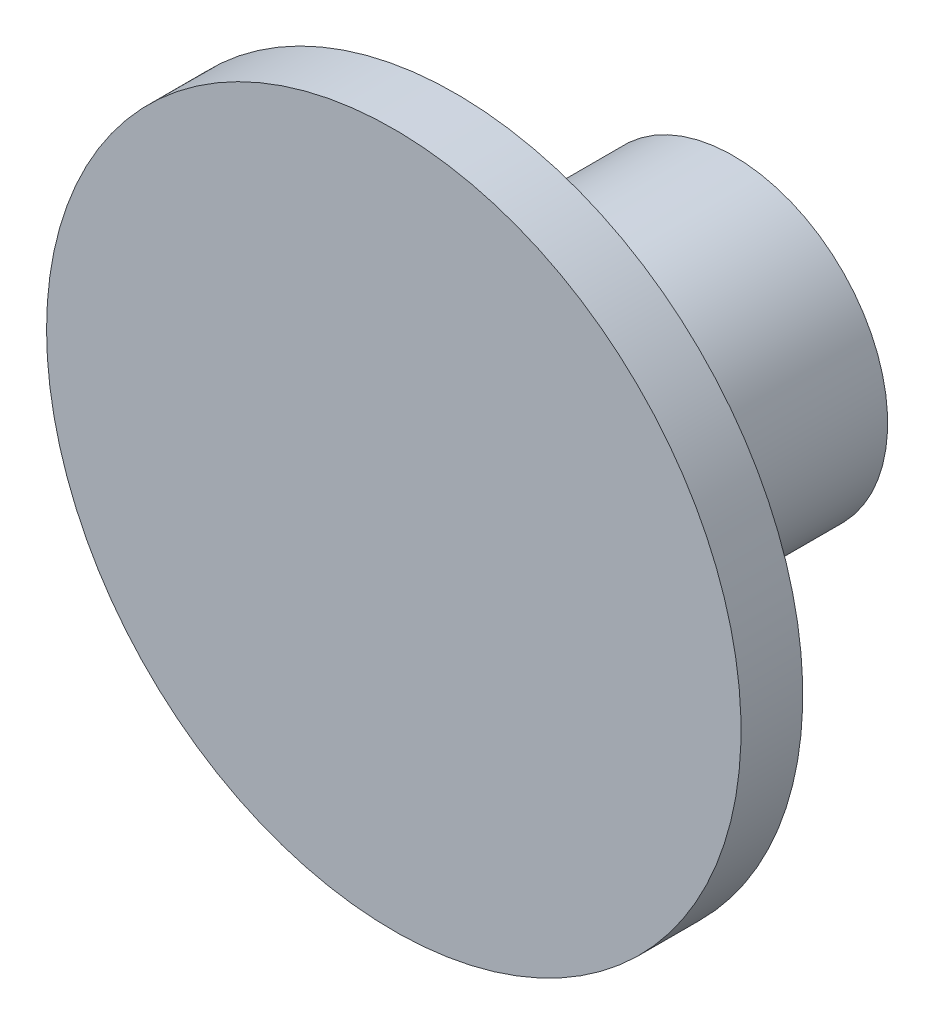
ISO-10303-21;
HEADER;
FILE_DESCRIPTION(('STEP AP214'),'2;1');
FILE_NAME('part.step','',(''),(''),'','','');
FILE_SCHEMA(('AUTOMOTIVE_DESIGN { 1 0 10303 214 1 1 1 1 }'));
ENDSEC;
DATA;
#1=APPLICATION_CONTEXT('core data for automotive mechanical design processes');
#2=APPLICATION_PROTOCOL_DEFINITION('international standard','automotive_design',2000,#1);
#3=PRODUCT_CONTEXT('',#1,'mechanical');
#4=PRODUCT('Part','Part','',(#3));
#5=PRODUCT_RELATED_PRODUCT_CATEGORY('part','',(#4));
#6=PRODUCT_DEFINITION_FORMATION('','',#4);
#7=PRODUCT_DEFINITION_CONTEXT('part definition',#1,'design');
#8=PRODUCT_DEFINITION('design','',#6,#7);
#9=PRODUCT_DEFINITION_SHAPE('','',#8);
#10=(LENGTH_UNIT() NAMED_UNIT(*) SI_UNIT(.MILLI.,.METRE.));
#11=(NAMED_UNIT(*) PLANE_ANGLE_UNIT() SI_UNIT($,.RADIAN.));
#12=(NAMED_UNIT(*) SI_UNIT($,.STERADIAN.) SOLID_ANGLE_UNIT());
#13=UNCERTAINTY_MEASURE_WITH_UNIT(LENGTH_MEASURE(1.E-05),#10,'distance_accuracy_value','');
#14=(GEOMETRIC_REPRESENTATION_CONTEXT(3) GLOBAL_UNCERTAINTY_ASSIGNED_CONTEXT((#13)) GLOBAL_UNIT_ASSIGNED_CONTEXT((#10,
#11,#12)) REPRESENTATION_CONTEXT('',''));
#15=CARTESIAN_POINT('',(0.,0.,0.));
#16=DIRECTION('',(0.,0.,1.));
#17=DIRECTION('',(1.,0.,0.));
#18=AXIS2_PLACEMENT_3D('',#15,#16,#17);
#19=CARTESIAN_POINT('',(0.,-10.05259329813,-35.9));
#20=DIRECTION('',(0.,0.,-1.));
#21=DIRECTION('',(-1.,0.,0.));
#22=AXIS2_PLACEMENT_3D('',#19,#20,#21);
#23=PLANE('',#22);
#24=CARTESIAN_POINT('',(0.,-10.05259329813,-35.9));
#25=DIRECTION('',(0.,0.,-1.));
#26=DIRECTION('',(-1.,0.,0.));
#27=AXIS2_PLACEMENT_3D('',#24,#25,#26);
#28=CIRCLE('',#27,2.);
#29=CARTESIAN_POINT('',(-2.,-10.05259329813,-35.9));
#30=VERTEX_POINT('',#29);
#31=EDGE_CURVE('E17',#30,#30,#28,.F.);
#32=ORIENTED_EDGE('',*,*,#31,.F.);
#33=EDGE_LOOP('',(#32));
#34=FACE_BOUND('',#33,.T.);
#35=ADVANCED_FACE('F14',(#34),#23,.T.);
#36=CARTESIAN_POINT('',(0.,-10.05259329813,-31.28));
#37=DIRECTION('',(0.,0.,-1.));
#38=DIRECTION('',(-1.,0.,0.));
#39=AXIS2_PLACEMENT_3D('',#36,#37,#38);
#40=CYLINDRICAL_SURFACE('',#39,2.);
#41=ORIENTED_EDGE('',*,*,#31,.T.);
#42=EDGE_LOOP('',(#41));
#43=FACE_BOUND('',#42,.T.);
#44=CARTESIAN_POINT('',(0.,-10.05259329813,-32.3));
#45=DIRECTION('',(0.,0.,-1.));
#46=DIRECTION('',(-1.,0.,0.));
#47=AXIS2_PLACEMENT_3D('',#44,#45,#46);
#48=CIRCLE('',#47,2.);
#49=CARTESIAN_POINT('',(-2.,-10.05259329813,-32.3));
#50=VERTEX_POINT('',#49);
#51=EDGE_CURVE('E26',#50,#50,#48,.F.);
#52=ORIENTED_EDGE('',*,*,#51,.F.);
#53=EDGE_LOOP('',(#52));
#54=FACE_BOUND('',#53,.T.);
#55=ADVANCED_FACE('F34',(#43,#54),#40,.T.);
#56=CARTESIAN_POINT('',(0.,-10.05259329813,-32.3));
#57=DIRECTION('',(0.,0.,-1.));
#58=DIRECTION('',(-1.,0.,0.));
#59=AXIS2_PLACEMENT_3D('',#56,#57,#58);
#60=PLANE('',#59);
#61=CARTESIAN_POINT('',(0.,-10.05259329813,-32.3));
#62=DIRECTION('',(0.,0.,-1.));
#63=DIRECTION('',(-1.,0.,0.));
#64=AXIS2_PLACEMENT_3D('',#61,#62,#63);
#65=CIRCLE('',#64,4.5);
#66=CARTESIAN_POINT('',(-4.5,-10.05259329813,-32.3));
#67=VERTEX_POINT('',#66);
#68=EDGE_CURVE('E21',#67,#67,#65,.F.);
#69=ORIENTED_EDGE('',*,*,#68,.F.);
#70=EDGE_LOOP('',(#69));
#71=FACE_BOUND('',#70,.T.);
#72=ORIENTED_EDGE('',*,*,#51,.T.);
#73=EDGE_LOOP('',(#72));
#74=FACE_BOUND('',#73,.T.);
#75=ADVANCED_FACE('F42',(#71,#74),#60,.T.);
#76=CARTESIAN_POINT('',(0.,-10.05259329813,-31.28));
#77=DIRECTION('',(0.,0.,-1.));
#78=DIRECTION('',(-1.,0.,0.));
#79=AXIS2_PLACEMENT_3D('',#76,#77,#78);
#80=CYLINDRICAL_SURFACE('',#79,4.5);
#81=ORIENTED_EDGE('',*,*,#68,.T.);
#82=EDGE_LOOP('',(#81));
#83=FACE_BOUND('',#82,.T.);
#84=CARTESIAN_POINT('',(0.,-10.05259329813,-31.5));
#85=DIRECTION('',(0.,0.,-1.));
#86=DIRECTION('',(-1.,0.,0.));
#87=AXIS2_PLACEMENT_3D('',#84,#85,#86);
#88=CIRCLE('',#87,4.5);
#89=CARTESIAN_POINT('',(-4.5,-10.05259329813,-31.5));
#90=VERTEX_POINT('',#89);
#91=EDGE_CURVE('E10',#90,#90,#88,.T.);
#92=ORIENTED_EDGE('',*,*,#91,.T.);
#93=EDGE_LOOP('',(#92));
#94=FACE_BOUND('',#93,.T.);
#95=ADVANCED_FACE('F45',(#83,#94),#80,.T.);
#96=CARTESIAN_POINT('',(0.,-10.05259329813,-31.5));
#97=DIRECTION('',(0.,0.,-1.));
#98=DIRECTION('',(-1.,0.,0.));
#99=AXIS2_PLACEMENT_3D('',#96,#97,#98);
#100=PLANE('',#99);
#101=ORIENTED_EDGE('',*,*,#91,.F.);
#102=EDGE_LOOP('',(#101));
#103=FACE_BOUND('',#102,.T.);
#104=ADVANCED_FACE('F43',(#103),#100,.F.);
#105=CLOSED_SHELL('',(#35,#55,#75,#95,#104));
#106=MANIFOLD_SOLID_BREP('B1',#105);
#107=ADVANCED_BREP_SHAPE_REPRESENTATION('',(#18,#106),#14);
#108=SHAPE_DEFINITION_REPRESENTATION(#9,#107);
ENDSEC;
END-ISO-10303-21;
